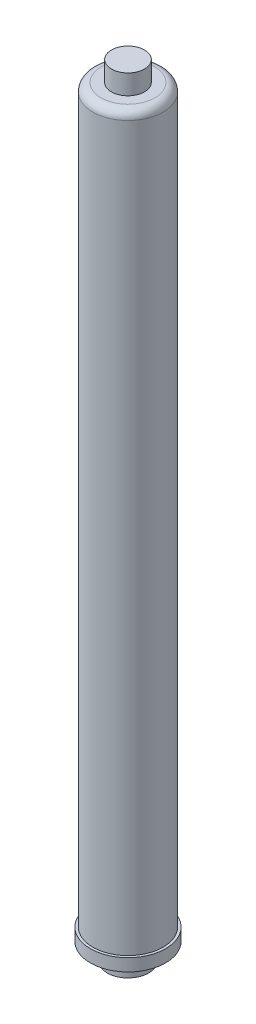
ISO-10303-21;
HEADER;
FILE_DESCRIPTION(('STEP AP214'),'2;1');
FILE_NAME('part.step','',(''),(''),'','','');
FILE_SCHEMA(('AUTOMOTIVE_DESIGN { 1 0 10303 214 1 1 1 1 }'));
ENDSEC;
DATA;
#1=APPLICATION_CONTEXT('core data for automotive mechanical design processes');
#2=APPLICATION_PROTOCOL_DEFINITION('international standard','automotive_design',2000,#1);
#3=PRODUCT_CONTEXT('',#1,'mechanical');
#4=PRODUCT('Part','Part','',(#3));
#5=PRODUCT_RELATED_PRODUCT_CATEGORY('part','',(#4));
#6=PRODUCT_DEFINITION_FORMATION('','',#4);
#7=PRODUCT_DEFINITION_CONTEXT('part definition',#1,'design');
#8=PRODUCT_DEFINITION('design','',#6,#7);
#9=PRODUCT_DEFINITION_SHAPE('','',#8);
#10=(LENGTH_UNIT() NAMED_UNIT(*) SI_UNIT(.MILLI.,.METRE.));
#11=(NAMED_UNIT(*) PLANE_ANGLE_UNIT() SI_UNIT($,.RADIAN.));
#12=(NAMED_UNIT(*) SI_UNIT($,.STERADIAN.) SOLID_ANGLE_UNIT());
#13=UNCERTAINTY_MEASURE_WITH_UNIT(LENGTH_MEASURE(1.E-05),#10,'distance_accuracy_value','');
#14=(GEOMETRIC_REPRESENTATION_CONTEXT(3) GLOBAL_UNCERTAINTY_ASSIGNED_CONTEXT((#13)) GLOBAL_UNIT_ASSIGNED_CONTEXT((#10,
#11,#12)) REPRESENTATION_CONTEXT('',''));
#15=CARTESIAN_POINT('',(0.,0.,0.));
#16=DIRECTION('',(0.,0.,1.));
#17=DIRECTION('',(1.,0.,0.));
#18=AXIS2_PLACEMENT_3D('',#15,#16,#17);
#19=CARTESIAN_POINT('',(0.,28.067,0.));
#20=DIRECTION('',(0.,-1.,0.));
#21=DIRECTION('',(1.,0.,0.));
#22=AXIS2_PLACEMENT_3D('',#19,#20,#21);
#23=CONICAL_SURFACE('',#22,0.,0.279949822523791);
#24=CARTESIAN_POINT('',(0.,-22.733,0.));
#25=DIRECTION('',(0.,1.,0.));
#26=DIRECTION('',(-1.,0.,0.));
#27=AXIS2_PLACEMENT_3D('',#24,#25,#26);
#28=CIRCLE('',#27,14.605);
#29=CARTESIAN_POINT('',(-14.6049999999999,-22.733,0.));
#30=VERTEX_POINT('',#29);
#31=EDGE_CURVE('E11',#30,#30,#28,.T.);
#32=ORIENTED_EDGE('',*,*,#31,.F.);
#33=EDGE_LOOP('',(#32));
#34=FACE_BOUND('',#33,.T.);
#35=CARTESIAN_POINT('',(0.,28.067,0.));
#36=VERTEX_POINT('',#35);
#37=VERTEX_LOOP('',#36);
#38=FACE_BOUND('',#37,.T.);
#39=ADVANCED_FACE('F33',(#34,#38),#23,.F.);
#40=CARTESIAN_POINT('',(14.6050000000001,-22.733,0.));
#41=DIRECTION('',(0.,1.,0.));
#42=DIRECTION('',(-1.,0.,0.));
#43=AXIS2_PLACEMENT_3D('',#40,#41,#42);
#44=PLANE('',#43);
#45=CARTESIAN_POINT('',(0.,-22.733,0.));
#46=DIRECTION('',(0.,1.,0.));
#47=DIRECTION('',(-1.,0.,0.));
#48=AXIS2_PLACEMENT_3D('',#45,#46,#47);
#49=CIRCLE('',#48,15.875);
#50=CARTESIAN_POINT('',(-15.8749999999999,-22.733,0.));
#51=VERTEX_POINT('',#50);
#52=EDGE_CURVE('E39',#51,#51,#49,.T.);
#53=ORIENTED_EDGE('',*,*,#52,.F.);
#54=EDGE_LOOP('',(#53));
#55=FACE_BOUND('',#54,.T.);
#56=ORIENTED_EDGE('',*,*,#31,.T.);
#57=EDGE_LOOP('',(#56));
#58=FACE_BOUND('',#57,.T.);
#59=ADVANCED_FACE('F43',(#55,#58),#44,.F.);
#60=CARTESIAN_POINT('',(0.,577.596,0.));
#61=DIRECTION('',(0.,1.,0.));
#62=DIRECTION('',(-1.,0.,0.));
#63=AXIS2_PLACEMENT_3D('',#60,#61,#62);
#64=CYLINDRICAL_SURFACE('',#63,15.875);
#65=CARTESIAN_POINT('',(0.,-9.52500000000001,0.));
#66=DIRECTION('',(0.,1.,0.));
#67=DIRECTION('',(-1.,0.,0.));
#68=AXIS2_PLACEMENT_3D('',#65,#66,#67);
#69=CIRCLE('',#68,15.875);
#70=CARTESIAN_POINT('',(-15.8749999999999,-9.52500000000001,0.));
#71=VERTEX_POINT('',#70);
#72=EDGE_CURVE('E115',#71,#71,#69,.T.);
#73=ORIENTED_EDGE('',*,*,#72,.F.);
#74=EDGE_LOOP('',(#73));
#75=FACE_BOUND('',#74,.T.);
#76=ORIENTED_EDGE('',*,*,#52,.T.);
#77=EDGE_LOOP('',(#76));
#78=FACE_BOUND('',#77,.T.);
#79=ADVANCED_FACE('F48',(#75,#78),#64,.T.);
#80=CARTESIAN_POINT('',(15.8750000000001,-9.525,0.));
#81=DIRECTION('',(0.,1.,0.));
#82=DIRECTION('',(-1.,0.,0.));
#83=AXIS2_PLACEMENT_3D('',#80,#81,#82);
#84=PLANE('',#83);
#85=CARTESIAN_POINT('',(0.,-9.52500000000001,0.));
#86=DIRECTION('',(0.,1.,0.));
#87=DIRECTION('',(-1.,0.,0.));
#88=AXIS2_PLACEMENT_3D('',#85,#86,#87);
#89=CIRCLE('',#88,28.8925);
#90=CARTESIAN_POINT('',(-28.8924999999999,-9.52500000000001,0.));
#91=VERTEX_POINT('',#90);
#92=EDGE_CURVE('E112',#91,#91,#89,.T.);
#93=ORIENTED_EDGE('',*,*,#92,.F.);
#94=EDGE_LOOP('',(#93));
#95=FACE_BOUND('',#94,.T.);
#96=ORIENTED_EDGE('',*,*,#72,.T.);
#97=EDGE_LOOP('',(#96));
#98=FACE_BOUND('',#97,.T.);
#99=ADVANCED_FACE('F55',(#95,#98),#84,.F.);
#100=CARTESIAN_POINT('',(0.,577.596,0.));
#101=DIRECTION('',(0.,1.,0.));
#102=DIRECTION('',(-1.,0.,0.));
#103=AXIS2_PLACEMENT_3D('',#100,#101,#102);
#104=CYLINDRICAL_SURFACE('',#103,28.8925);
#105=CARTESIAN_POINT('',(0.,0.,0.));
#106=DIRECTION('',(0.,1.,0.));
#107=DIRECTION('',(-1.,0.,0.));
#108=AXIS2_PLACEMENT_3D('',#105,#106,#107);
#109=CIRCLE('',#108,28.8924999999999);
#110=CARTESIAN_POINT('',(-28.8924999999999,0.,0.));
#111=VERTEX_POINT('',#110);
#112=EDGE_CURVE('E109',#111,#111,#109,.T.);
#113=ORIENTED_EDGE('',*,*,#112,.F.);
#114=EDGE_LOOP('',(#113));
#115=FACE_BOUND('',#114,.T.);
#116=ORIENTED_EDGE('',*,*,#92,.T.);
#117=EDGE_LOOP('',(#116));
#118=FACE_BOUND('',#117,.T.);
#119=ADVANCED_FACE('F62',(#115,#118),#104,.T.);
#120=CARTESIAN_POINT('',(28.8925,0.,0.));
#121=DIRECTION('',(0.,-1.,0.));
#122=DIRECTION('',(1.,0.,0.));
#123=AXIS2_PLACEMENT_3D('',#120,#121,#122);
#124=PLANE('',#123);
#125=CARTESIAN_POINT('',(0.,0.,0.));
#126=DIRECTION('',(0.,1.,0.));
#127=DIRECTION('',(-1.,0.,0.));
#128=AXIS2_PLACEMENT_3D('',#125,#126,#127);
#129=CIRCLE('',#128,26.9874999999999);
#130=CARTESIAN_POINT('',(-26.9874999999999,0.,0.));
#131=VERTEX_POINT('',#130);
#132=EDGE_CURVE('E106',#131,#131,#129,.T.);
#133=ORIENTED_EDGE('',*,*,#132,.F.);
#134=EDGE_LOOP('',(#133));
#135=FACE_BOUND('',#134,.T.);
#136=ORIENTED_EDGE('',*,*,#112,.T.);
#137=EDGE_LOOP('',(#136));
#138=FACE_BOUND('',#137,.T.);
#139=ADVANCED_FACE('F66',(#135,#138),#124,.F.);
#140=CARTESIAN_POINT('',(0.,577.596,0.));
#141=DIRECTION('',(0.,1.,0.));
#142=DIRECTION('',(-1.,0.,0.));
#143=AXIS2_PLACEMENT_3D('',#140,#141,#142);
#144=CYLINDRICAL_SURFACE('',#143,26.9875);
#145=CARTESIAN_POINT('',(0.,556.006,0.));
#146=DIRECTION('',(0.,1.,0.));
#147=DIRECTION('',(-1.,0.,0.));
#148=AXIS2_PLACEMENT_3D('',#145,#146,#147);
#149=CIRCLE('',#148,26.9875);
#150=CARTESIAN_POINT('',(-26.9875,556.006,0.));
#151=VERTEX_POINT('',#150);
#152=EDGE_CURVE('E103',#151,#151,#149,.T.);
#153=ORIENTED_EDGE('',*,*,#152,.F.);
#154=EDGE_LOOP('',(#153));
#155=FACE_BOUND('',#154,.T.);
#156=ORIENTED_EDGE('',*,*,#132,.T.);
#157=EDGE_LOOP('',(#156));
#158=FACE_BOUND('',#157,.T.);
#159=ADVANCED_FACE('F70',(#155,#158),#144,.T.);
#160=CARTESIAN_POINT('',(0.,556.006,0.));
#161=DIRECTION('',(0.,1.,0.));
#162=DIRECTION('',(-1.,0.,0.));
#163=AXIS2_PLACEMENT_3D('',#160,#161,#162);
#164=TOROIDAL_SURFACE('',#163,20.6375,6.35);
#165=CARTESIAN_POINT('',(0.,562.356,0.));
#166=DIRECTION('',(0.,1.,0.));
#167=DIRECTION('',(-1.,0.,0.));
#168=AXIS2_PLACEMENT_3D('',#165,#166,#167);
#169=CIRCLE('',#168,20.6375);
#170=CARTESIAN_POINT('',(-20.6375,562.356,0.));
#171=VERTEX_POINT('',#170);
#172=EDGE_CURVE('E98',#171,#171,#169,.T.);
#173=ORIENTED_EDGE('',*,*,#172,.F.);
#174=EDGE_LOOP('',(#173));
#175=FACE_BOUND('',#174,.T.);
#176=ORIENTED_EDGE('',*,*,#152,.T.);
#177=EDGE_LOOP('',(#176));
#178=FACE_BOUND('',#177,.T.);
#179=ADVANCED_FACE('F74',(#175,#178),#164,.T.);
#180=CARTESIAN_POINT('',(20.6375,562.356,0.));
#181=DIRECTION('',(0.,-1.,0.));
#182=DIRECTION('',(1.,0.,0.));
#183=AXIS2_PLACEMENT_3D('',#180,#181,#182);
#184=PLANE('',#183);
#185=CARTESIAN_POINT('',(0.,562.356,0.));
#186=DIRECTION('',(0.,1.,0.));
#187=DIRECTION('',(-1.,0.,0.));
#188=AXIS2_PLACEMENT_3D('',#185,#186,#187);
#189=CIRCLE('',#188,12.6999999999999);
#190=CARTESIAN_POINT('',(-12.6999999999999,562.356,0.));
#191=VERTEX_POINT('',#190);
#192=EDGE_CURVE('E95',#191,#191,#189,.T.);
#193=ORIENTED_EDGE('',*,*,#192,.F.);
#194=EDGE_LOOP('',(#193));
#195=FACE_BOUND('',#194,.T.);
#196=ORIENTED_EDGE('',*,*,#172,.T.);
#197=EDGE_LOOP('',(#196));
#198=FACE_BOUND('',#197,.T.);
#199=ADVANCED_FACE('F78',(#195,#198),#184,.F.);
#200=CARTESIAN_POINT('',(0.,577.596,0.));
#201=DIRECTION('',(0.,1.,0.));
#202=DIRECTION('',(-1.,0.,0.));
#203=AXIS2_PLACEMENT_3D('',#200,#201,#202);
#204=CYLINDRICAL_SURFACE('',#203,12.6999999999999);
#205=CARTESIAN_POINT('',(0.,577.596,0.));
#206=DIRECTION('',(0.,1.,0.));
#207=DIRECTION('',(-1.,0.,0.));
#208=AXIS2_PLACEMENT_3D('',#205,#206,#207);
#209=CIRCLE('',#208,12.6999999999999);
#210=CARTESIAN_POINT('',(-12.6999999999999,577.596,0.));
#211=VERTEX_POINT('',#210);
#212=EDGE_CURVE('E94',#211,#211,#209,.T.);
#213=ORIENTED_EDGE('',*,*,#212,.F.);
#214=EDGE_LOOP('',(#213));
#215=FACE_BOUND('',#214,.T.);
#216=ORIENTED_EDGE('',*,*,#192,.T.);
#217=EDGE_LOOP('',(#216));
#218=FACE_BOUND('',#217,.T.);
#219=ADVANCED_FACE('F82',(#215,#218),#204,.T.);
#220=CARTESIAN_POINT('',(12.6999999999999,577.596,0.));
#221=DIRECTION('',(0.,-1.,0.));
#222=DIRECTION('',(1.,0.,0.));
#223=AXIS2_PLACEMENT_3D('',#220,#221,#222);
#224=PLANE('',#223);
#225=ORIENTED_EDGE('',*,*,#212,.T.);
#226=EDGE_LOOP('',(#225));
#227=FACE_BOUND('',#226,.T.);
#228=ADVANCED_FACE('F86',(#227),#224,.F.);
#229=CLOSED_SHELL('',(#39,#59,#79,#99,#119,#139,#159,#179,#199,#219,#228));
#230=MANIFOLD_SOLID_BREP('B2',#229);
#231=ADVANCED_BREP_SHAPE_REPRESENTATION('',(#18,#230),#14);
#232=SHAPE_DEFINITION_REPRESENTATION(#9,#231);
ENDSEC;
END-ISO-10303-21;
